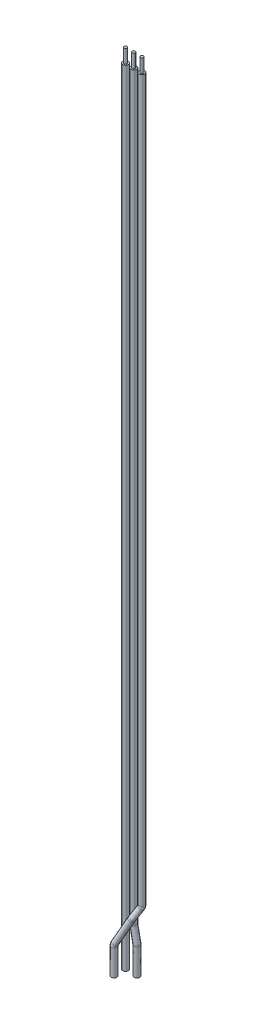
ISO-10303-21;
HEADER;
FILE_DESCRIPTION(('STEP AP214'),'2;1');
FILE_NAME('part.step','',(''),(''),'','','');
FILE_SCHEMA(('AUTOMOTIVE_DESIGN { 1 0 10303 214 1 1 1 1 }'));
ENDSEC;
DATA;
#1=APPLICATION_CONTEXT('core data for automotive mechanical design processes');
#2=APPLICATION_PROTOCOL_DEFINITION('international standard','automotive_design',2000,#1);
#3=PRODUCT_CONTEXT('',#1,'mechanical');
#4=PRODUCT('Part','Part','',(#3));
#5=PRODUCT_RELATED_PRODUCT_CATEGORY('part','',(#4));
#6=PRODUCT_DEFINITION_FORMATION('','',#4);
#7=PRODUCT_DEFINITION_CONTEXT('part definition',#1,'design');
#8=PRODUCT_DEFINITION('design','',#6,#7);
#9=PRODUCT_DEFINITION_SHAPE('','',#8);
#10=(LENGTH_UNIT() NAMED_UNIT(*) SI_UNIT(.MILLI.,.METRE.));
#11=(NAMED_UNIT(*) PLANE_ANGLE_UNIT() SI_UNIT($,.RADIAN.));
#12=(NAMED_UNIT(*) SI_UNIT($,.STERADIAN.) SOLID_ANGLE_UNIT());
#13=UNCERTAINTY_MEASURE_WITH_UNIT(LENGTH_MEASURE(1.E-05),#10,'distance_accuracy_value','');
#14=(GEOMETRIC_REPRESENTATION_CONTEXT(3) GLOBAL_UNCERTAINTY_ASSIGNED_CONTEXT((#13)) GLOBAL_UNIT_ASSIGNED_CONTEXT((#10,
#11,#12)) REPRESENTATION_CONTEXT('',''));
#15=CARTESIAN_POINT('',(0.,0.,0.));
#16=DIRECTION('',(0.,0.,1.));
#17=DIRECTION('',(1.,0.,0.));
#18=AXIS2_PLACEMENT_3D('',#15,#16,#17);
#19=CARTESIAN_POINT('',(0.,222.4,0.));
#20=DIRECTION('',(0.,1.,0.));
#21=DIRECTION('',(0.,0.,1.));
#22=AXIS2_PLACEMENT_3D('',#19,#20,#21);
#23=PLANE('',#22);
#24=CARTESIAN_POINT('',(-4.5,222.4,-3.15));
#25=DIRECTION('',(0.,1.,0.));
#26=DIRECTION('',(0.,0.,1.));
#27=AXIS2_PLACEMENT_3D('',#24,#25,#26);
#28=CIRCLE('',#27,0.55);
#29=CARTESIAN_POINT('',(-4.5,222.4,-2.6));
#30=VERTEX_POINT('',#29);
#31=EDGE_CURVE('P0_E17',#30,#30,#28,.F.);
#32=ORIENTED_EDGE('',*,*,#31,.F.);
#33=EDGE_LOOP('',(#32));
#34=FACE_BOUND('',#33,.T.);
#35=ADVANCED_FACE('P0_F14',(#34),#23,.T.);
#36=CARTESIAN_POINT('',(-4.5,217.4,-3.15));
#37=DIRECTION('',(0.,1.,0.));
#38=DIRECTION('',(0.,0.,1.));
#39=AXIS2_PLACEMENT_3D('',#36,#37,#38);
#40=CYLINDRICAL_SURFACE('',#39,0.55);
#41=ORIENTED_EDGE('',*,*,#31,.T.);
#42=EDGE_LOOP('',(#41));
#43=FACE_BOUND('',#42,.T.);
#44=CARTESIAN_POINT('',(-4.5,217.4,-3.15));
#45=DIRECTION('',(0.,1.,0.));
#46=DIRECTION('',(0.,0.,1.));
#47=AXIS2_PLACEMENT_3D('',#44,#45,#46);
#48=CIRCLE('',#47,0.55);
#49=CARTESIAN_POINT('',(-4.5,217.4,-2.6));
#50=VERTEX_POINT('',#49);
#51=EDGE_CURVE('P0_E26',#50,#50,#48,.F.);
#52=ORIENTED_EDGE('',*,*,#51,.F.);
#53=EDGE_LOOP('',(#52));
#54=FACE_BOUND('',#53,.T.);
#55=ADVANCED_FACE('P0_F34',(#43,#54),#40,.T.);
#56=CARTESIAN_POINT('',(-4.5,-71.,-3.15));
#57=DIRECTION('',(0.,-1.,0.));
#58=DIRECTION('',(0.,0.,-1.));
#59=AXIS2_PLACEMENT_3D('',#56,#57,#58);
#60=PLANE('',#59);
#61=CARTESIAN_POINT('',(-4.5,-71.,-3.15));
#62=DIRECTION('',(0.,-1.,0.));
#63=DIRECTION('',(0.,0.,-1.));
#64=AXIS2_PLACEMENT_3D('',#61,#62,#63);
#65=CIRCLE('',#64,1.05);
#66=CARTESIAN_POINT('',(-4.5,-71.,-4.2));
#67=VERTEX_POINT('',#66);
#68=EDGE_CURVE('P0_E21',#67,#67,#65,.F.);
#69=ORIENTED_EDGE('',*,*,#68,.F.);
#70=EDGE_LOOP('',(#69));
#71=FACE_BOUND('',#70,.T.);
#72=ADVANCED_FACE('P0_F42',(#71),#60,.T.);
#73=CARTESIAN_POINT('',(0.,217.4,0.));
#74=DIRECTION('',(0.,1.,0.));
#75=DIRECTION('',(0.,0.,1.));
#76=AXIS2_PLACEMENT_3D('',#73,#74,#75);
#77=PLANE('',#76);
#78=ORIENTED_EDGE('',*,*,#51,.T.);
#79=EDGE_LOOP('',(#78));
#80=FACE_BOUND('',#79,.T.);
#81=CARTESIAN_POINT('',(-4.5,217.4,-3.15));
#82=DIRECTION('',(0.,-1.,0.));
#83=DIRECTION('',(0.,0.,-1.));
#84=AXIS2_PLACEMENT_3D('',#81,#82,#83);
#85=CIRCLE('',#84,1.05);
#86=CARTESIAN_POINT('',(-4.5,217.4,-4.2));
#87=VERTEX_POINT('',#86);
#88=EDGE_CURVE('P0_E10',#87,#87,#85,.T.);
#89=ORIENTED_EDGE('',*,*,#88,.F.);
#90=EDGE_LOOP('',(#89));
#91=FACE_BOUND('',#90,.T.);
#92=ADVANCED_FACE('P0_F45',(#80,#91),#77,.T.);
#93=CARTESIAN_POINT('',(-4.5,-30.42926937766,-3.15));
#94=DIRECTION('',(0.,-1.,0.));
#95=DIRECTION('',(0.,0.,-1.));
#96=AXIS2_PLACEMENT_3D('',#93,#94,#95);
#97=CYLINDRICAL_SURFACE('',#96,1.05);
#98=ORIENTED_EDGE('',*,*,#88,.T.);
#99=EDGE_LOOP('',(#98));
#100=FACE_BOUND('',#99,.T.);
#101=ORIENTED_EDGE('',*,*,#68,.T.);
#102=EDGE_LOOP('',(#101));
#103=FACE_BOUND('',#102,.T.);
#104=ADVANCED_FACE('P0_F43',(#100,#103),#97,.T.);
#105=CLOSED_SHELL('',(#35,#55,#72,#92,#104));
#106=MANIFOLD_SOLID_BREP('P0_B1',#105);
#107=CARTESIAN_POINT('',(-0.3,-71.,-3.15));
#108=DIRECTION('',(0.,-1.,0.));
#109=DIRECTION('',(0.,0.,-1.));
#110=AXIS2_PLACEMENT_3D('',#107,#108,#109);
#111=PLANE('',#110);
#112=CARTESIAN_POINT('',(-0.3,-71.,-3.15));
#113=DIRECTION('',(0.,-1.,0.));
#114=DIRECTION('',(0.,0.,-1.));
#115=AXIS2_PLACEMENT_3D('',#112,#113,#114);
#116=CIRCLE('',#115,1.05);
#117=CARTESIAN_POINT('',(-0.3,-71.,-4.2));
#118=VERTEX_POINT('',#117);
#119=EDGE_CURVE('P1_E17',#118,#118,#116,.F.);
#120=ORIENTED_EDGE('',*,*,#119,.F.);
#121=EDGE_LOOP('',(#120));
#122=FACE_BOUND('',#121,.T.);
#123=ADVANCED_FACE('P1_F14',(#122),#111,.T.);
#124=CARTESIAN_POINT('',(-0.3,-61.19803902719,-3.15));
#125=DIRECTION('',(0.,-1.,0.));
#126=DIRECTION('',(0.,0.,-1.));
#127=AXIS2_PLACEMENT_3D('',#124,#125,#126);
#128=CYLINDRICAL_SURFACE('',#127,1.05);
#129=ORIENTED_EDGE('',*,*,#119,.T.);
#130=EDGE_LOOP('',(#129));
#131=FACE_BOUND('',#130,.T.);
#132=CARTESIAN_POINT('',(-0.300000000000002,-61.19803902719,-3.15));
#133=DIRECTION('',(0.,-1.,0.));
#134=DIRECTION('',(1.,0.,0.));
#135=AXIS2_PLACEMENT_3D('',#132,#133,#134);
#136=CIRCLE('',#135,1.05);
#137=CARTESIAN_POINT('',(0.749999999999998,-61.19803902719,-3.15));
#138=VERTEX_POINT('',#137);
#139=EDGE_CURVE('P1_E30',#138,#138,#136,.F.);
#140=ORIENTED_EDGE('',*,*,#139,.F.);
#141=EDGE_LOOP('',(#140));
#142=FACE_BOUND('',#141,.T.);
#143=ADVANCED_FACE('P1_F53',(#131,#142),#128,.T.);
#144=CARTESIAN_POINT('',(-2.3,-61.19803902719,-3.15));
#145=DIRECTION('',(0.,0.,-1.));
#146=DIRECTION('',(-0.980580675690917,-0.196116135138202,0.));
#147=AXIS2_PLACEMENT_3D('',#144,#145,#146);
#148=TOROIDAL_SURFACE('',#147,2.,1.05);
#149=ORIENTED_EDGE('',*,*,#139,.T.);
#150=EDGE_LOOP('',(#149));
#151=FACE_BOUND('',#150,.T.);
#152=CARTESIAN_POINT('',(-0.338838648619857,-60.8058067569051,-3.15));
#153=DIRECTION('',(0.196116135138203,-0.980580675690916,0.));
#154=DIRECTION('',(0.980580675690916,0.196116135138203,0.));
#155=AXIS2_PLACEMENT_3D('',#152,#153,#154);
#156=CIRCLE('',#155,1.05);
#157=CARTESIAN_POINT('',(0.690771060855605,-60.59988481501,-3.15));
#158=VERTEX_POINT('',#157);
#159=EDGE_CURVE('P1_E36',#158,#158,#156,.F.);
#160=ORIENTED_EDGE('',*,*,#159,.F.);
#161=EDGE_LOOP('',(#160));
#162=FACE_BOUND('',#161,.T.);
#163=ADVANCED_FACE('P1_F49',(#151,#162),#148,.T.);
#164=CARTESIAN_POINT('',(0.,222.4,0.));
#165=DIRECTION('',(0.,1.,0.));
#166=DIRECTION('',(0.,0.,1.));
#167=AXIS2_PLACEMENT_3D('',#164,#165,#166);
#168=PLANE('',#167);
#169=CARTESIAN_POINT('',(-1.5,222.4,-3.15));
#170=DIRECTION('',(0.,1.,0.));
#171=DIRECTION('',(0.,0.,1.));
#172=AXIS2_PLACEMENT_3D('',#169,#170,#171);
#173=CIRCLE('',#172,0.55);
#174=CARTESIAN_POINT('',(-1.5,222.4,-2.6));
#175=VERTEX_POINT('',#174);
#176=EDGE_CURVE('P1_E34',#175,#175,#173,.F.);
#177=ORIENTED_EDGE('',*,*,#176,.F.);
#178=EDGE_LOOP('',(#177));
#179=FACE_BOUND('',#178,.T.);
#180=ADVANCED_FACE('P1_F52',(#179),#168,.T.);
#181=CARTESIAN_POINT('',(-1.441742027073,-55.29128986464,-3.15));
#182=DIRECTION('',(0.196116135138203,-0.980580675690916,0.));
#183=DIRECTION('',(0.980580675690916,0.196116135138203,0.));
#184=AXIS2_PLACEMENT_3D('',#181,#182,#183);
#185=CYLINDRICAL_SURFACE('',#184,1.05);
#186=ORIENTED_EDGE('',*,*,#159,.T.);
#187=EDGE_LOOP('',(#186));
#188=FACE_BOUND('',#187,.T.);
#189=CARTESIAN_POINT('',(-1.4417420270727,-55.2912898646348,-3.15));
#190=DIRECTION('',(0.196116135138279,-0.980580675690901,0.));
#191=DIRECTION('',(-0.980580675690901,-0.196116135138279,0.));
#192=AXIS2_PLACEMENT_3D('',#189,#190,#191);
#193=CIRCLE('',#192,1.05);
#194=CARTESIAN_POINT('',(-2.47135173654815,-55.49721180653,-3.15));
#195=VERTEX_POINT('',#194);
#196=EDGE_CURVE('P1_E33',#195,#195,#193,.F.);
#197=ORIENTED_EDGE('',*,*,#196,.F.);
#198=EDGE_LOOP('',(#197));
#199=FACE_BOUND('',#198,.T.);
#200=ADVANCED_FACE('P1_F83',(#188,#199),#185,.T.);
#201=CARTESIAN_POINT('',(-1.5,217.4,-3.15));
#202=DIRECTION('',(0.,1.,0.));
#203=DIRECTION('',(0.,0.,1.));
#204=AXIS2_PLACEMENT_3D('',#201,#202,#203);
#205=CYLINDRICAL_SURFACE('',#204,0.55);
#206=ORIENTED_EDGE('',*,*,#176,.T.);
#207=EDGE_LOOP('',(#206));
#208=FACE_BOUND('',#207,.T.);
#209=CARTESIAN_POINT('',(-1.5,217.4,-3.15));
#210=DIRECTION('',(0.,1.,0.));
#211=DIRECTION('',(0.,0.,1.));
#212=AXIS2_PLACEMENT_3D('',#209,#210,#211);
#213=CIRCLE('',#212,0.55);
#214=CARTESIAN_POINT('',(-1.5,217.4,-2.6));
#215=VERTEX_POINT('',#214);
#216=EDGE_CURVE('P1_E26',#215,#215,#213,.F.);
#217=ORIENTED_EDGE('',*,*,#216,.F.);
#218=EDGE_LOOP('',(#217));
#219=FACE_BOUND('',#218,.T.);
#220=ADVANCED_FACE('P1_F79',(#208,#219),#205,.T.);
#221=CARTESIAN_POINT('',(1.5,-54.70294145922,-3.15));
#222=DIRECTION('',(0.,0.,1.));
#223=DIRECTION('',(1.,0.,0.));
#224=AXIS2_PLACEMENT_3D('',#221,#222,#223);
#225=TOROIDAL_SURFACE('',#224,3.,1.05);
#226=ORIENTED_EDGE('',*,*,#196,.T.);
#227=EDGE_LOOP('',(#226));
#228=FACE_BOUND('',#227,.T.);
#229=CARTESIAN_POINT('',(-1.5,-54.70294145922,-3.15));
#230=DIRECTION('',(0.,-1.,0.));
#231=DIRECTION('',(0.,0.,-1.));
#232=AXIS2_PLACEMENT_3D('',#229,#230,#231);
#233=CIRCLE('',#232,1.05);
#234=CARTESIAN_POINT('',(-1.5,-54.70294145922,-4.2));
#235=VERTEX_POINT('',#234);
#236=EDGE_CURVE('P1_E21',#235,#235,#233,.F.);
#237=ORIENTED_EDGE('',*,*,#236,.F.);
#238=EDGE_LOOP('',(#237));
#239=FACE_BOUND('',#238,.T.);
#240=ADVANCED_FACE('P1_F72',(#228,#239),#225,.T.);
#241=CARTESIAN_POINT('',(0.,217.4,0.));
#242=DIRECTION('',(0.,1.,0.));
#243=DIRECTION('',(0.,0.,1.));
#244=AXIS2_PLACEMENT_3D('',#241,#242,#243);
#245=PLANE('',#244);
#246=ORIENTED_EDGE('',*,*,#216,.T.);
#247=EDGE_LOOP('',(#246));
#248=FACE_BOUND('',#247,.T.);
#249=CARTESIAN_POINT('',(-1.5,217.4,-3.15));
#250=DIRECTION('',(0.,-1.,0.));
#251=DIRECTION('',(0.,0.,-1.));
#252=AXIS2_PLACEMENT_3D('',#249,#250,#251);
#253=CIRCLE('',#252,1.05);
#254=CARTESIAN_POINT('',(-1.5,217.4,-4.2));
#255=VERTEX_POINT('',#254);
#256=EDGE_CURVE('P1_E10',#255,#255,#253,.T.);
#257=ORIENTED_EDGE('',*,*,#256,.F.);
#258=EDGE_LOOP('',(#257));
#259=FACE_BOUND('',#258,.T.);
#260=ADVANCED_FACE('P1_F67',(#248,#259),#245,.T.);
#261=CARTESIAN_POINT('',(-1.5,-31.42926937766,-3.15));
#262=DIRECTION('',(0.,-1.,0.));
#263=DIRECTION('',(0.,0.,-1.));
#264=AXIS2_PLACEMENT_3D('',#261,#262,#263);
#265=CYLINDRICAL_SURFACE('',#264,1.05);
#266=ORIENTED_EDGE('',*,*,#256,.T.);
#267=EDGE_LOOP('',(#266));
#268=FACE_BOUND('',#267,.T.);
#269=ORIENTED_EDGE('',*,*,#236,.T.);
#270=EDGE_LOOP('',(#269));
#271=FACE_BOUND('',#270,.T.);
#272=ADVANCED_FACE('P1_F65',(#268,#271),#265,.T.);
#273=CLOSED_SHELL('',(#123,#143,#163,#180,#200,#220,#240,#260,#272));
#274=MANIFOLD_SOLID_BREP('P1_B1',#273);
#275=CARTESIAN_POINT('',(-4.5,-71.,1.05));
#276=DIRECTION('',(0.,-1.,0.));
#277=DIRECTION('',(0.,0.,-1.));
#278=AXIS2_PLACEMENT_3D('',#275,#276,#277);
#279=PLANE('',#278);
#280=CARTESIAN_POINT('',(-4.5,-71.,1.05));
#281=DIRECTION('',(0.,-1.,0.));
#282=DIRECTION('',(0.,0.,-1.));
#283=AXIS2_PLACEMENT_3D('',#280,#281,#282);
#284=CIRCLE('',#283,1.05);
#285=CARTESIAN_POINT('',(-4.5,-71.,0.));
#286=VERTEX_POINT('',#285);
#287=EDGE_CURVE('P2_E17',#286,#286,#284,.F.);
#288=ORIENTED_EDGE('',*,*,#287,.F.);
#289=EDGE_LOOP('',(#288));
#290=FACE_BOUND('',#289,.T.);
#291=ADVANCED_FACE('P2_F14',(#290),#279,.T.);
#292=CARTESIAN_POINT('',(-4.5,-61.49459432767,1.05));
#293=DIRECTION('',(0.,-1.,0.));
#294=DIRECTION('',(0.,0.,-1.));
#295=AXIS2_PLACEMENT_3D('',#292,#293,#294);
#296=CYLINDRICAL_SURFACE('',#295,1.05);
#297=ORIENTED_EDGE('',*,*,#287,.T.);
#298=EDGE_LOOP('',(#297));
#299=FACE_BOUND('',#298,.T.);
#300=CARTESIAN_POINT('',(-4.5000000000003,-61.49459432767,1.05000000000005));
#301=DIRECTION('',(0.,-1.,0.));
#302=DIRECTION('',(-0.885831535280148,0.,0.464006994670573));
#303=AXIS2_PLACEMENT_3D('',#300,#301,#302);
#304=CIRCLE('',#303,1.05);
#305=CARTESIAN_POINT('',(-5.43012311204445,-61.49459432767,1.53720734440415));
#306=VERTEX_POINT('',#305);
#307=EDGE_CURVE('P2_E30',#306,#306,#304,.F.);
#308=ORIENTED_EDGE('',*,*,#307,.F.);
#309=EDGE_LOOP('',(#308));
#310=FACE_BOUND('',#309,.T.);
#311=ADVANCED_FACE('P2_F67',(#299,#310),#296,.T.);
#312=CARTESIAN_POINT('',(-2.72833692944,-61.49459432767,0.1219860106589));
#313=DIRECTION('',(0.464006994670573,0.,0.885831535280148));
#314=DIRECTION('',(0.783728132495721,-0.466090169801717,-0.410524259878728));
#315=AXIS2_PLACEMENT_3D('',#312,#313,#314);
#316=TOROIDAL_SURFACE('',#315,2.,1.05);
#317=ORIENTED_EDGE('',*,*,#307,.T.);
#318=EDGE_LOOP('',(#317));
#319=FACE_BOUND('',#318,.T.);
#320=CARTESIAN_POINT('',(-4.29579319443066,-60.562413988067,0.943034530416556));
#321=DIRECTION('',(-0.412877370694412,-0.884737222916626,0.216269098935206));
#322=DIRECTION('',(0.906183139995271,-0.422885465331113,0.));
#323=AXIS2_PLACEMENT_3D('',#320,#321,#322);
#324=CIRCLE('',#323,1.05);
#325=CARTESIAN_POINT('',(-3.34430089743563,-61.0064437266646,0.943034530416556));
#326=VERTEX_POINT('',#325);
#327=EDGE_CURVE('P2_E47',#326,#326,#324,.F.);
#328=ORIENTED_EDGE('',*,*,#327,.F.);
#329=EDGE_LOOP('',(#328));
#330=FACE_BOUND('',#329,.T.);
#331=ADVANCED_FACE('P2_F64',(#319,#330),#316,.T.);
#332=CARTESIAN_POINT('',(-0.3871130070202,-52.18667072933,-1.104369377275));
#333=DIRECTION('',(-0.412877370694412,-0.884737222916626,0.216269098935206));
#334=DIRECTION('',(0.906183139995271,-0.422885465331113,0.));
#335=AXIS2_PLACEMENT_3D('',#332,#333,#334);
#336=CYLINDRICAL_SURFACE('',#335,1.05);
#337=ORIENTED_EDGE('',*,*,#327,.T.);
#338=EDGE_LOOP('',(#337));
#339=FACE_BOUND('',#338,.T.);
#340=CARTESIAN_POINT('',(-0.387113007021003,-52.1866707293262,-1.1043693772743));
#341=DIRECTION('',(-0.41287737069454,-0.884737222916782,0.216269098934322));
#342=DIRECTION('',(0.145713088883396,0.1702291623819,0.974571561252849));
#343=AXIS2_PLACEMENT_3D('',#340,#341,#342);
#344=CIRCLE('',#343,1.05);
#345=CARTESIAN_POINT('',(-0.234114263693437,-52.0079301088252,-0.0810692379588074));
#346=VERTEX_POINT('',#345);
#347=EDGE_CURVE('P2_E42',#346,#346,#344,.F.);
#348=ORIENTED_EDGE('',*,*,#347,.F.);
#349=EDGE_LOOP('',(#348));
#350=FACE_BOUND('',#349,.T.);
#351=ADVANCED_FACE('P2_F59',(#339,#350),#336,.T.);
#352=CARTESIAN_POINT('',(-0.6785391847878,-52.52712905409,-3.05351249978));
#353=DIRECTION('',(0.899055044197196,-0.433891782199498,-0.0586340246215498));
#354=DIRECTION('',(-0.228659627914918,-0.351097939316203,-0.907989543755723));
#355=AXIS2_PLACEMENT_3D('',#352,#353,#354);
#356=TOROIDAL_SURFACE('',#355,2.,1.05);
#357=ORIENTED_EDGE('',*,*,#347,.T.);
#358=EDGE_LOOP('',(#357));
#359=FACE_BOUND('',#358,.T.);
#360=CARTESIAN_POINT('',(-0.221219928957375,-51.8249331754637,-1.23753341227014));
#361=DIRECTION('',(-0.373382916140303,-0.829739813645007,0.414869906822503));
#362=DIRECTION('',(0.,-0.447213595499958,-0.894427190999916));
#363=AXIS2_PLACEMENT_3D('',#360,#361,#362);
#364=CIRCLE('',#363,1.05);
#365=CARTESIAN_POINT('',(-0.221219928957375,-52.2945074507387,-2.17668196282005));
#366=VERTEX_POINT('',#365);
#367=EDGE_CURVE('P2_E36',#366,#366,#364,.F.);
#368=ORIENTED_EDGE('',*,*,#367,.F.);
#369=EDGE_LOOP('',(#368));
#370=FACE_BOUND('',#369,.T.);
#371=ADVANCED_FACE('P2_F54',(#359,#370),#356,.T.);
#372=CARTESIAN_POINT('',(0.,222.4,0.));
#373=DIRECTION('',(0.,1.,0.));
#374=DIRECTION('',(0.,0.,1.));
#375=AXIS2_PLACEMENT_3D('',#372,#373,#374);
#376=PLANE('',#375);
#377=CARTESIAN_POINT('',(1.5,222.4,-3.15));
#378=DIRECTION('',(0.,1.,0.));
#379=DIRECTION('',(0.,0.,1.));
#380=AXIS2_PLACEMENT_3D('',#377,#378,#379);
#381=CIRCLE('',#380,0.55);
#382=CARTESIAN_POINT('',(1.5,222.4,-2.6));
#383=VERTEX_POINT('',#382);
#384=EDGE_CURVE('P2_E34',#383,#383,#381,.F.);
#385=ORIENTED_EDGE('',*,*,#384,.F.);
#386=EDGE_LOOP('',(#385));
#387=FACE_BOUND('',#386,.T.);
#388=ADVANCED_FACE('P2_F58',(#387),#376,.T.);
#389=CARTESIAN_POINT('',(1.272203880258,-48.50621359943,-2.896893200287));
#390=DIRECTION('',(-0.373382916140303,-0.829739813645007,0.414869906822503));
#391=DIRECTION('',(0.,-0.447213595499958,-0.894427190999916));
#392=AXIS2_PLACEMENT_3D('',#389,#390,#391);
#393=CYLINDRICAL_SURFACE('',#392,1.05);
#394=ORIENTED_EDGE('',*,*,#367,.T.);
#395=EDGE_LOOP('',(#394));
#396=FACE_BOUND('',#395,.T.);
#397=CARTESIAN_POINT('',(1.27220388025897,-48.5062135994248,-2.89689320028822));
#398=DIRECTION('',(-0.37338291613954,-0.829739813645722,0.414869906821761));
#399=DIRECTION('',(0.555066671751935,-0.558150375482417,-0.616740746391113));
#400=AXIS2_PLACEMENT_3D('',#397,#398,#399);
#401=CIRCLE('',#400,1.05);
#402=CARTESIAN_POINT('',(1.8550238855985,-49.0922714936814,-3.54447098399889));
#403=VERTEX_POINT('',#402);
#404=EDGE_CURVE('P2_E33',#403,#403,#401,.F.);
#405=ORIENTED_EDGE('',*,*,#404,.F.);
#406=EDGE_LOOP('',(#405));
#407=FACE_BOUND('',#406,.T.);
#408=ADVANCED_FACE('P2_F102',(#396,#407),#393,.T.);
#409=CARTESIAN_POINT('',(1.5,217.4,-3.15));
#410=DIRECTION('',(0.,1.,0.));
#411=DIRECTION('',(0.,0.,1.));
#412=AXIS2_PLACEMENT_3D('',#409,#410,#411);
#413=CYLINDRICAL_SURFACE('',#412,0.55);
#414=ORIENTED_EDGE('',*,*,#384,.T.);
#415=EDGE_LOOP('',(#414));
#416=FACE_BOUND('',#415,.T.);
#417=CARTESIAN_POINT('',(1.5,217.4,-3.15));
#418=DIRECTION('',(0.,1.,0.));
#419=DIRECTION('',(0.,0.,1.));
#420=AXIS2_PLACEMENT_3D('',#417,#418,#419);
#421=CIRCLE('',#420,0.55);
#422=CARTESIAN_POINT('',(1.5,217.4,-2.6));
#423=VERTEX_POINT('',#422);
#424=EDGE_CURVE('P2_E26',#423,#423,#421,.F.);
#425=ORIENTED_EDGE('',*,*,#424,.F.);
#426=EDGE_LOOP('',(#425));
#427=FACE_BOUND('',#426,.T.);
#428=ADVANCED_FACE('P2_F98',(#416,#427),#413,.T.);
#429=CARTESIAN_POINT('',(0.1620705367551,-47.38991284846,-1.663411707506));
#430=DIRECTION('',(-0.743294146247206,0.,-0.668964731622406));
#431=DIRECTION('',(-0.668964731622405,0.,0.743294146247206));
#432=AXIS2_PLACEMENT_3D('',#429,#430,#431);
#433=TOROIDAL_SURFACE('',#432,2.,1.05);
#434=ORIENTED_EDGE('',*,*,#404,.T.);
#435=EDGE_LOOP('',(#434));
#436=FACE_BOUND('',#435,.T.);
#437=CARTESIAN_POINT('',(1.5,-47.38991284846,-3.15));
#438=DIRECTION('',(0.,-1.,0.));
#439=DIRECTION('',(0.,0.,-1.));
#440=AXIS2_PLACEMENT_3D('',#437,#438,#439);
#441=CIRCLE('',#440,1.05);
#442=CARTESIAN_POINT('',(1.5,-47.38991284846,-4.2));
#443=VERTEX_POINT('',#442);
#444=EDGE_CURVE('P2_E21',#443,#443,#441,.F.);
#445=ORIENTED_EDGE('',*,*,#444,.F.);
#446=EDGE_LOOP('',(#445));
#447=FACE_BOUND('',#446,.T.);
#448=ADVANCED_FACE('P2_F91',(#436,#447),#433,.T.);
#449=CARTESIAN_POINT('',(0.,217.4,0.));
#450=DIRECTION('',(0.,1.,0.));
#451=DIRECTION('',(0.,0.,1.));
#452=AXIS2_PLACEMENT_3D('',#449,#450,#451);
#453=PLANE('',#452);
#454=ORIENTED_EDGE('',*,*,#424,.T.);
#455=EDGE_LOOP('',(#454));
#456=FACE_BOUND('',#455,.T.);
#457=CARTESIAN_POINT('',(1.5,217.4,-3.15));
#458=DIRECTION('',(0.,-1.,0.));
#459=DIRECTION('',(0.,0.,-1.));
#460=AXIS2_PLACEMENT_3D('',#457,#458,#459);
#461=CIRCLE('',#460,1.05);
#462=CARTESIAN_POINT('',(1.5,217.4,-4.2));
#463=VERTEX_POINT('',#462);
#464=EDGE_CURVE('P2_E10',#463,#463,#461,.T.);
#465=ORIENTED_EDGE('',*,*,#464,.F.);
#466=EDGE_LOOP('',(#465));
#467=FACE_BOUND('',#466,.T.);
#468=ADVANCED_FACE('P2_F86',(#456,#467),#453,.T.);
#469=CARTESIAN_POINT('',(1.5,-32.42926937766,-3.15));
#470=DIRECTION('',(0.,-1.,0.));
#471=DIRECTION('',(0.,0.,-1.));
#472=AXIS2_PLACEMENT_3D('',#469,#470,#471);
#473=CYLINDRICAL_SURFACE('',#472,1.05);
#474=ORIENTED_EDGE('',*,*,#464,.T.);
#475=EDGE_LOOP('',(#474));
#476=FACE_BOUND('',#475,.T.);
#477=ORIENTED_EDGE('',*,*,#444,.T.);
#478=EDGE_LOOP('',(#477));
#479=FACE_BOUND('',#478,.T.);
#480=ADVANCED_FACE('P2_F84',(#476,#479),#473,.T.);
#481=CLOSED_SHELL('',(#291,#311,#331,#351,#371,#388,#408,#428,#448,#468,#480));
#482=MANIFOLD_SOLID_BREP('P2_B1',#481);
#483=ADVANCED_BREP_SHAPE_REPRESENTATION('',(#18,#106,#274,#482),#14);
#484=SHAPE_DEFINITION_REPRESENTATION(#9,#483);
ENDSEC;
END-ISO-10303-21;
